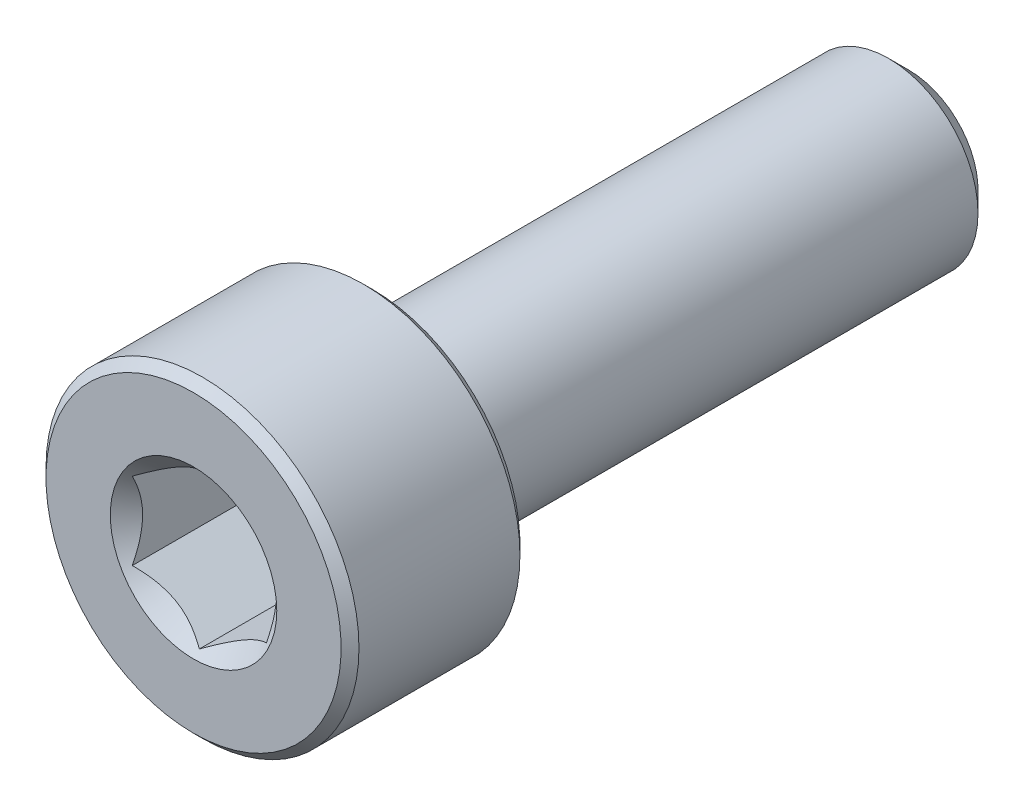
ISO-10303-21;
HEADER;
FILE_DESCRIPTION(('STEP AP214'),'2;1');
FILE_NAME('part.step','',(''),(''),'','','');
FILE_SCHEMA(('AUTOMOTIVE_DESIGN { 1 0 10303 214 1 1 1 1 }'));
ENDSEC;
DATA;
#1=APPLICATION_CONTEXT('core data for automotive mechanical design processes');
#2=APPLICATION_PROTOCOL_DEFINITION('international standard','automotive_design',2000,#1);
#3=PRODUCT_CONTEXT('',#1,'mechanical');
#4=PRODUCT('Part','Part','',(#3));
#5=PRODUCT_RELATED_PRODUCT_CATEGORY('part','',(#4));
#6=PRODUCT_DEFINITION_FORMATION('','',#4);
#7=PRODUCT_DEFINITION_CONTEXT('part definition',#1,'design');
#8=PRODUCT_DEFINITION('design','',#6,#7);
#9=PRODUCT_DEFINITION_SHAPE('','',#8);
#10=(LENGTH_UNIT() NAMED_UNIT(*) SI_UNIT(.MILLI.,.METRE.));
#11=(NAMED_UNIT(*) PLANE_ANGLE_UNIT() SI_UNIT($,.RADIAN.));
#12=(NAMED_UNIT(*) SI_UNIT($,.STERADIAN.) SOLID_ANGLE_UNIT());
#13=UNCERTAINTY_MEASURE_WITH_UNIT(LENGTH_MEASURE(1.E-05),#10,'distance_accuracy_value','');
#14=(GEOMETRIC_REPRESENTATION_CONTEXT(3) GLOBAL_UNCERTAINTY_ASSIGNED_CONTEXT((#13)) GLOBAL_UNIT_ASSIGNED_CONTEXT((#10,
#11,#12)) REPRESENTATION_CONTEXT('',''));
#15=CARTESIAN_POINT('',(0.,0.,0.));
#16=DIRECTION('',(0.,0.,1.));
#17=DIRECTION('',(1.,0.,0.));
#18=AXIS2_PLACEMENT_3D('',#15,#16,#17);
#19=CARTESIAN_POINT('',(0.,1.54533666301317,-8.));
#20=DIRECTION('',(0.,0.,-1.));
#21=DIRECTION('',(0.,1.,0.));
#22=AXIS2_PLACEMENT_3D('',#19,#20,#21);
#23=PLANE('',#22);
#24=CARTESIAN_POINT('',(0.,0.,-8.));
#25=DIRECTION('',(0.,0.,-1.));
#26=DIRECTION('',(0.,1.,0.));
#27=AXIS2_PLACEMENT_3D('',#24,#25,#26);
#28=CIRCLE('',#27,1.54533666301317);
#29=CARTESIAN_POINT('',(0.,1.54533666301317,-8.));
#30=VERTEX_POINT('',#29);
#31=EDGE_CURVE('E57',#30,#30,#28,.T.);
#32=ORIENTED_EDGE('',*,*,#31,.T.);
#33=EDGE_LOOP('',(#32));
#34=FACE_BOUND('',#33,.T.);
#35=ADVANCED_FACE('F43',(#34),#23,.T.);
#36=CARTESIAN_POINT('',(0.,0.,-8.));
#37=DIRECTION('',(0.,0.,1.));
#38=DIRECTION('',(0.,-1.,0.));
#39=AXIS2_PLACEMENT_3D('',#36,#37,#38);
#40=CONICAL_SURFACE('',#39,1.54533666301317,0.785398163397446);
#41=CARTESIAN_POINT('',(0.,0.,-7.54533666301317));
#42=DIRECTION('',(0.,0.,-1.));
#43=DIRECTION('',(0.,1.,0.));
#44=AXIS2_PLACEMENT_3D('',#41,#42,#43);
#45=CIRCLE('',#44,2.);
#46=CARTESIAN_POINT('',(0.,2.,-7.54533666301317));
#47=VERTEX_POINT('',#46);
#48=EDGE_CURVE('E175',#47,#47,#45,.T.);
#49=ORIENTED_EDGE('',*,*,#48,.T.);
#50=EDGE_LOOP('',(#49));
#51=FACE_BOUND('',#50,.T.);
#52=ORIENTED_EDGE('',*,*,#31,.F.);
#53=EDGE_LOOP('',(#52));
#54=FACE_BOUND('',#53,.T.);
#55=ADVANCED_FACE('F183',(#51,#54),#40,.T.);
#56=CARTESIAN_POINT('',(0.,0.,-8.));
#57=DIRECTION('',(0.,0.,-1.));
#58=DIRECTION('',(0.,1.,0.));
#59=AXIS2_PLACEMENT_3D('',#56,#57,#58);
#60=CYLINDRICAL_SURFACE('',#59,2.);
#61=CARTESIAN_POINT('',(0.,0.,3.8));
#62=DIRECTION('',(0.,0.,-1.));
#63=DIRECTION('',(0.,1.,0.));
#64=AXIS2_PLACEMENT_3D('',#61,#62,#63);
#65=CIRCLE('',#64,2.);
#66=CARTESIAN_POINT('',(0.,2.,3.8));
#67=VERTEX_POINT('',#66);
#68=EDGE_CURVE('E171',#67,#67,#65,.T.);
#69=ORIENTED_EDGE('',*,*,#68,.T.);
#70=EDGE_LOOP('',(#69));
#71=FACE_BOUND('',#70,.T.);
#72=ORIENTED_EDGE('',*,*,#48,.F.);
#73=EDGE_LOOP('',(#72));
#74=FACE_BOUND('',#73,.T.);
#75=ADVANCED_FACE('F185',(#71,#74),#60,.T.);
#76=CARTESIAN_POINT('',(0.,0.,3.8));
#77=DIRECTION('',(0.,0.,-1.));
#78=DIRECTION('',(0.,1.,0.));
#79=AXIS2_PLACEMENT_3D('',#76,#77,#78);
#80=TOROIDAL_SURFACE('',#79,2.2,0.200000000000001);
#81=CARTESIAN_POINT('',(0.,0.,4.));
#82=DIRECTION('',(0.,0.,-1.));
#83=DIRECTION('',(0.,1.,0.));
#84=AXIS2_PLACEMENT_3D('',#81,#82,#83);
#85=CIRCLE('',#84,2.2);
#86=CARTESIAN_POINT('',(0.,2.2,4.));
#87=VERTEX_POINT('',#86);
#88=EDGE_CURVE('E167',#87,#87,#85,.T.);
#89=ORIENTED_EDGE('',*,*,#88,.T.);
#90=EDGE_LOOP('',(#89));
#91=FACE_BOUND('',#90,.T.);
#92=ORIENTED_EDGE('',*,*,#68,.F.);
#93=EDGE_LOOP('',(#92));
#94=FACE_BOUND('',#93,.T.);
#95=ADVANCED_FACE('F191',(#91,#94),#80,.F.);
#96=CARTESIAN_POINT('',(0.,3.3,4.));
#97=DIRECTION('',(0.,0.,-1.));
#98=DIRECTION('',(0.,1.,0.));
#99=AXIS2_PLACEMENT_3D('',#96,#97,#98);
#100=PLANE('',#99);
#101=CARTESIAN_POINT('',(0.,0.,4.));
#102=DIRECTION('',(0.,0.,-1.));
#103=DIRECTION('',(0.,1.,0.));
#104=AXIS2_PLACEMENT_3D('',#101,#102,#103);
#105=CIRCLE('',#104,3.3);
#106=CARTESIAN_POINT('',(0.,3.3,4.));
#107=VERTEX_POINT('',#106);
#108=EDGE_CURVE('E163',#107,#107,#105,.T.);
#109=ORIENTED_EDGE('',*,*,#108,.T.);
#110=EDGE_LOOP('',(#109));
#111=FACE_BOUND('',#110,.T.);
#112=ORIENTED_EDGE('',*,*,#88,.F.);
#113=EDGE_LOOP('',(#112));
#114=FACE_BOUND('',#113,.T.);
#115=ADVANCED_FACE('F197',(#111,#114),#100,.T.);
#116=CARTESIAN_POINT('',(0.,0.,4.));
#117=DIRECTION('',(0.,0.,1.));
#118=DIRECTION('',(0.,-1.,0.));
#119=AXIS2_PLACEMENT_3D('',#116,#117,#118);
#120=CONICAL_SURFACE('',#119,3.3,0.785398163397452);
#121=CARTESIAN_POINT('',(0.,0.,4.2));
#122=DIRECTION('',(0.,0.,-1.));
#123=DIRECTION('',(0.,1.,0.));
#124=AXIS2_PLACEMENT_3D('',#121,#122,#123);
#125=CIRCLE('',#124,3.5);
#126=CARTESIAN_POINT('',(0.,3.5,4.2));
#127=VERTEX_POINT('',#126);
#128=EDGE_CURVE('E159',#127,#127,#125,.T.);
#129=ORIENTED_EDGE('',*,*,#128,.T.);
#130=EDGE_LOOP('',(#129));
#131=FACE_BOUND('',#130,.T.);
#132=ORIENTED_EDGE('',*,*,#108,.F.);
#133=EDGE_LOOP('',(#132));
#134=FACE_BOUND('',#133,.T.);
#135=ADVANCED_FACE('F201',(#131,#134),#120,.T.);
#136=CARTESIAN_POINT('',(0.,0.,-8.));
#137=DIRECTION('',(0.,0.,-1.));
#138=DIRECTION('',(0.,1.,0.));
#139=AXIS2_PLACEMENT_3D('',#136,#137,#138);
#140=CYLINDRICAL_SURFACE('',#139,3.5);
#141=CARTESIAN_POINT('',(0.,0.,7.8));
#142=DIRECTION('',(0.,0.,-1.));
#143=DIRECTION('',(0.,1.,0.));
#144=AXIS2_PLACEMENT_3D('',#141,#142,#143);
#145=CIRCLE('',#144,3.5);
#146=CARTESIAN_POINT('',(0.,3.5,7.8));
#147=VERTEX_POINT('',#146);
#148=EDGE_CURVE('E155',#147,#147,#145,.T.);
#149=ORIENTED_EDGE('',*,*,#148,.T.);
#150=EDGE_LOOP('',(#149));
#151=FACE_BOUND('',#150,.T.);
#152=ORIENTED_EDGE('',*,*,#128,.F.);
#153=EDGE_LOOP('',(#152));
#154=FACE_BOUND('',#153,.T.);
#155=ADVANCED_FACE('F205',(#151,#154),#140,.T.);
#156=CARTESIAN_POINT('',(0.,0.,7.8));
#157=DIRECTION('',(0.,0.,-1.));
#158=DIRECTION('',(0.,1.,0.));
#159=AXIS2_PLACEMENT_3D('',#156,#157,#158);
#160=CONICAL_SURFACE('',#159,3.5,0.785398163397452);
#161=CARTESIAN_POINT('',(0.,0.,8.));
#162=DIRECTION('',(0.,0.,-1.));
#163=DIRECTION('',(0.,1.,0.));
#164=AXIS2_PLACEMENT_3D('',#161,#162,#163);
#165=CIRCLE('',#164,3.3);
#166=CARTESIAN_POINT('',(0.,3.3,8.));
#167=VERTEX_POINT('',#166);
#168=EDGE_CURVE('E151',#167,#167,#165,.T.);
#169=ORIENTED_EDGE('',*,*,#168,.T.);
#170=EDGE_LOOP('',(#169));
#171=FACE_BOUND('',#170,.T.);
#172=ORIENTED_EDGE('',*,*,#148,.F.);
#173=EDGE_LOOP('',(#172));
#174=FACE_BOUND('',#173,.T.);
#175=ADVANCED_FACE('F209',(#171,#174),#160,.T.);
#176=CARTESIAN_POINT('',(0.,0.,8.));
#177=DIRECTION('',(0.,0.,1.));
#178=DIRECTION('',(0.,-1.,0.));
#179=AXIS2_PLACEMENT_3D('',#176,#177,#178);
#180=PLANE('',#179);
#181=CARTESIAN_POINT('',(0.,0.,8.));
#182=DIRECTION('',(0.,0.,1.));
#183=DIRECTION('',(1.,0.,0.));
#184=AXIS2_PLACEMENT_3D('',#181,#182,#183);
#185=CIRCLE('',#184,1.86195461813654);
#186=CARTESIAN_POINT('',(1.86195461813654,0.,8.));
#187=VERTEX_POINT('',#186);
#188=EDGE_CURVE('E117',#187,#187,#185,.T.);
#189=ORIENTED_EDGE('',*,*,#188,.F.);
#190=EDGE_LOOP('',(#189));
#191=FACE_BOUND('',#190,.T.);
#192=ORIENTED_EDGE('',*,*,#168,.F.);
#193=EDGE_LOOP('',(#192));
#194=FACE_BOUND('',#193,.T.);
#195=ADVANCED_FACE('F213',(#191,#194),#180,.T.);
#196=CARTESIAN_POINT('',(0.,0.,8.));
#197=DIRECTION('',(0.,0.,1.));
#198=DIRECTION('',(1.,0.,0.));
#199=AXIS2_PLACEMENT_3D('',#196,#197,#198);
#200=CONICAL_SURFACE('',#199,1.86195461813654,0.78539816339745);
#201=ORIENTED_EDGE('',*,*,#188,.T.);
#202=EDGE_LOOP('',(#201));
#203=FACE_BOUND('',#202,.T.);
#204=CARTESIAN_POINT('',(-0.000199999999999267,-1.73216627762272,7.87021167103241));
#205=CARTESIAN_POINT('',(0.0513677907370764,-1.70239359975915,7.84046166549966));
#206=CARTESIAN_POINT('',(0.103797917665202,-1.67212305186355,7.81245867334265));
#207=CARTESIAN_POINT('',(0.210709034055597,-1.61039789003619,7.76118541987248));
#208=CARTESIAN_POINT('',(0.265200195814662,-1.57893740312614,7.73794369447671));
#209=CARTESIAN_POINT('',(0.375079081357249,-1.51549879897987,7.69812991842456));
#210=CARTESIAN_POINT('',(0.4304388090952,-1.4835368452681,7.68145777510323));
#211=CARTESIAN_POINT('',(0.542377257477151,-1.41890915196211,7.65577064625044));
#212=CARTESIAN_POINT('',(0.598952556553009,-1.38624538781118,7.6467364799112));
#213=CARTESIAN_POINT('',(0.696455389516441,-1.32995210095299,7.63858527065919));
#214=CARTESIAN_POINT('',(0.737256908280467,-1.30639533311124,7.63737844242155));
#215=CARTESIAN_POINT('',(0.818787969615859,-1.25932335290193,7.6394102465946));
#216=CARTESIAN_POINT('',(0.859517494314631,-1.23580815085313,7.64264986018064));
#217=CARTESIAN_POINT('',(0.940584402163417,-1.18900414978427,7.6533881754143));
#218=CARTESIAN_POINT('',(0.980921384598289,-1.16571558211719,7.66089084245107));
#219=CARTESIAN_POINT('',(1.06091833691403,-1.11952932016335,7.67974780136063));
#220=CARTESIAN_POINT('',(1.10057800851621,-1.09663179808786,7.69110374645092));
#221=CARTESIAN_POINT('',(1.20216313477449,-1.03798159809698,7.72481783702501));
#222=CARTESIAN_POINT('',(1.26345855370969,-1.00259267147465,7.7497180385257));
#223=CARTESIAN_POINT('',(1.35358562846331,-0.950557780604374,7.79175284270391));
#224=CARTESIAN_POINT('',(1.38328513990772,-0.933410759677148,7.80652134299143));
#225=CARTESIAN_POINT('',(1.44213790138375,-0.899432101996407,7.8374067553725));
#226=CARTESIAN_POINT('',(1.47129140422064,-0.88260031928571,7.85352302355405));
#227=CARTESIAN_POINT('',(1.5002,-0.865909933730601,7.87021167103241));
#228=B_SPLINE_CURVE_WITH_KNOTS('',3,(#204,#205,#206,#207,#208,#209,#210,#211,#212,#213,#214,
#215,#216,#217,#218,#219,#220,#221,#222,#223,#224,#225,#226,#227),.UNSPECIFIED.,.F.,.F.,(4,2,2,
2,2,2,2,2,2,2,2,4),(0.,0.199829143693305,0.400822987382389,0.598623720538181,0.795926240188889,
0.937113067959881,1.07833105577193,1.21968061668222,1.36109089931054,1.58570969637565,
1.69770705470963,1.80965120737194),.UNSPECIFIED.);
#229=CARTESIAN_POINT('',(0.,-1.73205080756888,7.87009618943234));
#230=VERTEX_POINT('',#229);
#231=CARTESIAN_POINT('',(1.5,-0.866025403784439,7.87009618943233));
#232=VERTEX_POINT('',#231);
#233=EDGE_CURVE('E12',#230,#232,#228,.T.);
#234=ORIENTED_EDGE('',*,*,#233,.F.);
#235=CARTESIAN_POINT('',(-1.5002,-0.865909933730601,7.87021167103241));
#236=CARTESIAN_POINT('',(-1.44863220926292,-0.895682611594166,7.84046166549966));
#237=CARTESIAN_POINT('',(-1.3962020823348,-0.925953159489765,7.81245867334265));
#238=CARTESIAN_POINT('',(-1.2892909659444,-0.987678321317124,7.76118541987248));
#239=CARTESIAN_POINT('',(-1.23479980418534,-1.01913880822718,7.73794369447671));
#240=CARTESIAN_POINT('',(-1.12492091864275,-1.08257741237344,7.69812991842456));
#241=CARTESIAN_POINT('',(-1.0695611909048,-1.11453936608521,7.68145777510323));
#242=CARTESIAN_POINT('',(-0.957622742522849,-1.1791670593912,7.65577064625044));
#243=CARTESIAN_POINT('',(-0.901047443446991,-1.21183082354213,7.6467364799112));
#244=CARTESIAN_POINT('',(-0.803544610483559,-1.26812411040032,7.63858527065919));
#245=CARTESIAN_POINT('',(-0.762743091719534,-1.29168087824208,7.63737844242155));
#246=CARTESIAN_POINT('',(-0.681212030384142,-1.33875285845138,7.6394102465946));
#247=CARTESIAN_POINT('',(-0.64048250568537,-1.36226806050018,7.64264986018064));
#248=CARTESIAN_POINT('',(-0.559415597836584,-1.40907206156905,7.6533881754143));
#249=CARTESIAN_POINT('',(-0.519078615401712,-1.43236062923612,7.66089084245107));
#250=CARTESIAN_POINT('',(-0.439081663085969,-1.47854689118996,7.67974780136063));
#251=CARTESIAN_POINT('',(-0.399421991483792,-1.50144441326545,7.69110374645092));
#252=CARTESIAN_POINT('',(-0.297836865225515,-1.56009461325633,7.72481783702501));
#253=CARTESIAN_POINT('',(-0.236541446290311,-1.59548353987866,7.7497180385257));
#254=CARTESIAN_POINT('',(-0.146414371536687,-1.64751843074894,7.79175284270391));
#255=CARTESIAN_POINT('',(-0.116714860092283,-1.66466545167617,7.80652134299143));
#256=CARTESIAN_POINT('',(-0.0578620986162491,-1.69864410935691,7.8374067553725));
#257=CARTESIAN_POINT('',(-0.0287085957793627,-1.71547589206761,7.85352302355404));
#258=CARTESIAN_POINT('',(0.000200000000000315,-1.73216627762272,7.87021167103241));
#259=B_SPLINE_CURVE_WITH_KNOTS('',3,(#235,#236,#237,#238,#239,#240,#241,#242,#243,#244,#245,
#246,#247,#248,#249,#250,#251,#252,#253,#254,#255,#256,#257,#258),.UNSPECIFIED.,.F.,.F.,(4,2,2,
2,2,2,2,2,2,2,2,4),(0.,0.199829143693304,0.400822987382388,0.598623720538181,0.795926240188889,
0.937113067959881,1.07833105577193,1.21968061668222,1.36109089931054,1.58570969637565,
1.69770705470964,1.80965120737194),.UNSPECIFIED.);
#260=CARTESIAN_POINT('',(-1.5,-0.866025403784439,7.87009618943234));
#261=VERTEX_POINT('',#260);
#262=EDGE_CURVE('E102',#261,#230,#259,.T.);
#263=ORIENTED_EDGE('',*,*,#262,.F.);
#264=CARTESIAN_POINT('',(-1.5,-1.81798631684901,8.49496588290931));
#265=CARTESIAN_POINT('',(-1.5,-1.77410479833239,8.46112335419702));
#266=CARTESIAN_POINT('',(-1.5,-1.72998897047494,8.42758561768896));
#267=CARTESIAN_POINT('',(-1.5,-1.64119029432319,8.36124817349268));
#268=CARTESIAN_POINT('',(-1.5,-1.59650731534755,8.328448640911));
#269=CARTESIAN_POINT('',(-1.5,-1.460806940489,8.23088193148043));
#270=CARTESIAN_POINT('',(-1.5,-1.36880251235632,8.1674654206559));
#271=CARTESIAN_POINT('',(-1.5,-1.17526237686872,8.04210237172158));
#272=CARTESIAN_POINT('',(-1.5,-1.07349393006072,7.98051141536721));
#273=CARTESIAN_POINT('',(-1.5,-0.864764842560628,7.86725220599653));
#274=CARTESIAN_POINT('',(-1.5,-0.75782333444995,7.81555043950584));
#275=CARTESIAN_POINT('',(-1.5,-0.598146069886858,7.75227317361643));
#276=CARTESIAN_POINT('',(-1.5,-0.547969945491557,7.73427408399124));
#277=CARTESIAN_POINT('',(-1.5,-0.446326869364775,7.70229546522083));
#278=CARTESIAN_POINT('',(-1.5,-0.394859836419925,7.68831618966241));
#279=CARTESIAN_POINT('',(-1.5,-0.291848397493325,7.66536569037263));
#280=CARTESIAN_POINT('',(-1.5,-0.240324749628771,7.65630281543282));
#281=CARTESIAN_POINT('',(-1.5,-0.13662544851591,7.64337711521516));
#282=CARTESIAN_POINT('',(-1.5,-0.0844499362377799,7.6395131846234));
#283=CARTESIAN_POINT('',(-1.5,0.0176806967011133,7.63731961256892));
#284=CARTESIAN_POINT('',(-1.5,0.067630704511662,7.63875006923659));
#285=CARTESIAN_POINT('',(-1.5,0.167145477637761,7.64651331423855));
#286=CARTESIAN_POINT('',(-1.5,0.216710207908514,7.6528465433779));
#287=CARTESIAN_POINT('',(-1.5,0.315937150651983,7.67016271707146));
#288=CARTESIAN_POINT('',(-1.5,0.365584733694539,7.68122815181031));
#289=CARTESIAN_POINT('',(-1.5,0.46378160619877,7.70739349919908));
#290=CARTESIAN_POINT('',(-1.5,0.512330953840259,7.72249319758548));
#291=CARTESIAN_POINT('',(-1.5,0.661313023287691,7.77461385569168));
#292=CARTESIAN_POINT('',(-1.5,0.759720789706278,7.81740496304236));
#293=CARTESIAN_POINT('',(-1.5,0.951942669022771,7.91263883721007));
#294=CARTESIAN_POINT('',(-1.5,1.04573912191844,7.96511552648595));
#295=CARTESIAN_POINT('',(-1.5,1.22504153577549,8.0734783373155));
#296=CARTESIAN_POINT('',(-1.5,1.3107282773288,8.12906910554414));
#297=CARTESIAN_POINT('',(-1.5,1.43696960041027,8.21505045621636));
#298=CARTESIAN_POINT('',(-1.5,1.47850725450332,8.24402268297088));
#299=CARTESIAN_POINT('',(-1.5,1.56101250374723,8.30274488393776));
#300=CARTESIAN_POINT('',(-1.5,1.60198025290925,8.33249464151831));
#301=CARTESIAN_POINT('',(-1.5,1.64271029717086,8.36256715528604));
#302=B_SPLINE_CURVE_WITH_KNOTS('',3,(#264,#265,#266,#267,#268,#269,#270,#271,#272,#273,#274,
#275,#276,#277,#278,#279,#280,#281,#282,#283,#284,#285,#286,#287,#288,#289,#290,#291,#292,#293,
#294,#295,#296,#297,#298,#299,#300,#301),.UNSPECIFIED.,.F.,.F.,(4,2,2,2,2,2,2,2,2,2,2,2,2,2,2,2,
2,2,4),(0.,0.166243250325255,0.332525527595493,0.667617582874062,1.02421660314856,
1.37958485991001,1.53937185590113,1.69916892971772,1.85587466130012,2.01254707142443,
2.16220898927398,2.31188436469119,2.46428258498153,2.61667271286895,2.93766301623296,
3.25979964661299,3.56606529199603,3.71798989158865,3.86987260467919),.UNSPECIFIED.);
#303=CARTESIAN_POINT('',(-1.5,0.866025403784438,7.87009618943233));
#304=VERTEX_POINT('',#303);
#305=EDGE_CURVE('E116',#304,#261,#302,.F.);
#306=ORIENTED_EDGE('',*,*,#305,.F.);
#307=CARTESIAN_POINT('',(0.000199999999999471,1.73216627762272,7.87021167103241));
#308=CARTESIAN_POINT('',(-0.0513677907370761,1.70239359975915,7.84046166549966));
#309=CARTESIAN_POINT('',(-0.103797917665201,1.67212305186355,7.81245867334265));
#310=CARTESIAN_POINT('',(-0.210709034055597,1.61039789003619,7.76118541987248));
#311=CARTESIAN_POINT('',(-0.265200195814661,1.57893740312614,7.73794369447671));
#312=CARTESIAN_POINT('',(-0.375079081357249,1.51549879897987,7.69812991842456));
#313=CARTESIAN_POINT('',(-0.4304388090952,1.4835368452681,7.68145777510323));
#314=CARTESIAN_POINT('',(-0.542377257477151,1.41890915196211,7.65577064625044));
#315=CARTESIAN_POINT('',(-0.598952556553009,1.38624538781118,7.6467364799112));
#316=CARTESIAN_POINT('',(-0.696455389516441,1.32995210095299,7.63858527065919));
#317=CARTESIAN_POINT('',(-0.737256908280467,1.30639533311124,7.63737844242155));
#318=CARTESIAN_POINT('',(-0.818787969615859,1.25932335290193,7.6394102465946));
#319=CARTESIAN_POINT('',(-0.85951749431463,1.23580815085313,7.64264986018064));
#320=CARTESIAN_POINT('',(-0.940584402163416,1.18900414978427,7.6533881754143));
#321=CARTESIAN_POINT('',(-0.980921384598288,1.1657155821172,7.66089084245107));
#322=CARTESIAN_POINT('',(-1.06091833691403,1.11952932016335,7.67974780136063));
#323=CARTESIAN_POINT('',(-1.10057800851621,1.09663179808786,7.69110374645092));
#324=CARTESIAN_POINT('',(-1.20216313477449,1.03798159809698,7.72481783702501));
#325=CARTESIAN_POINT('',(-1.26345855370969,1.00259267147465,7.7497180385257));
#326=CARTESIAN_POINT('',(-1.35358562846331,0.950557780604375,7.79175284270391));
#327=CARTESIAN_POINT('',(-1.38328513990772,0.933410759677147,7.80652134299143));
#328=CARTESIAN_POINT('',(-1.44213790138375,0.899432101996407,7.8374067553725));
#329=CARTESIAN_POINT('',(-1.47129140422064,0.88260031928571,7.85352302355404));
#330=CARTESIAN_POINT('',(-1.5002,0.865909933730601,7.87021167103241));
#331=B_SPLINE_CURVE_WITH_KNOTS('',3,(#307,#308,#309,#310,#311,#312,#313,#314,#315,#316,#317,
#318,#319,#320,#321,#322,#323,#324,#325,#326,#327,#328,#329,#330),.UNSPECIFIED.,.F.,.F.,(4,2,2,
2,2,2,2,2,2,2,2,4),(0.,0.199829143693305,0.400822987382389,0.598623720538181,0.795926240188889,
0.937113067959881,1.07833105577193,1.21968061668222,1.36109089931054,1.58570969637565,
1.69770705470963,1.80965120737194),.UNSPECIFIED.);
#332=CARTESIAN_POINT('',(0.,1.73205080756888,7.87009618943234));
#333=VERTEX_POINT('',#332);
#334=EDGE_CURVE('E264',#333,#304,#331,.T.);
#335=ORIENTED_EDGE('',*,*,#334,.F.);
#336=CARTESIAN_POINT('',(1.5002,0.865909933730601,7.87021167103241));
#337=CARTESIAN_POINT('',(1.44863220926292,0.895682611594166,7.84046166549966));
#338=CARTESIAN_POINT('',(1.3962020823348,0.925953159489765,7.81245867334265));
#339=CARTESIAN_POINT('',(1.2892909659444,0.987678321317124,7.76118541987248));
#340=CARTESIAN_POINT('',(1.23479980418534,1.01913880822718,7.73794369447671));
#341=CARTESIAN_POINT('',(1.12492091864275,1.08257741237344,7.69812991842456));
#342=CARTESIAN_POINT('',(1.0695611909048,1.11453936608521,7.68145777510323));
#343=CARTESIAN_POINT('',(0.957622742522849,1.1791670593912,7.65577064625044));
#344=CARTESIAN_POINT('',(0.901047443446991,1.21183082354213,7.6467364799112));
#345=CARTESIAN_POINT('',(0.803544610483559,1.26812411040032,7.63858527065919));
#346=CARTESIAN_POINT('',(0.762743091719534,1.29168087824208,7.63737844242155));
#347=CARTESIAN_POINT('',(0.681212030384142,1.33875285845138,7.6394102465946));
#348=CARTESIAN_POINT('',(0.64048250568537,1.36226806050018,7.64264986018064));
#349=CARTESIAN_POINT('',(0.559415597836584,1.40907206156905,7.6533881754143));
#350=CARTESIAN_POINT('',(0.519078615401712,1.43236062923612,7.66089084245107));
#351=CARTESIAN_POINT('',(0.439081663085969,1.47854689118996,7.67974780136062));
#352=CARTESIAN_POINT('',(0.399421991483792,1.50144441326545,7.69110374645092));
#353=CARTESIAN_POINT('',(0.297836865225515,1.56009461325633,7.72481783702501));
#354=CARTESIAN_POINT('',(0.236541446290311,1.59548353987866,7.7497180385257));
#355=CARTESIAN_POINT('',(0.146414371536687,1.64751843074894,7.79175284270391));
#356=CARTESIAN_POINT('',(0.116714860092283,1.66466545167617,7.80652134299143));
#357=CARTESIAN_POINT('',(0.0578620986162498,1.69864410935691,7.8374067553725));
#358=CARTESIAN_POINT('',(0.0287085957793633,1.71547589206761,7.85352302355404));
#359=CARTESIAN_POINT('',(-0.000200000000000031,1.73216627762272,7.87021167103241));
#360=B_SPLINE_CURVE_WITH_KNOTS('',3,(#336,#337,#338,#339,#340,#341,#342,#343,#344,#345,#346,
#347,#348,#349,#350,#351,#352,#353,#354,#355,#356,#357,#358,#359),.UNSPECIFIED.,.F.,.F.,(4,2,2,
2,2,2,2,2,2,2,2,4),(0.,0.199829143693305,0.400822987382388,0.598623720538181,0.795926240188889,
0.937113067959881,1.07833105577193,1.21968061668222,1.36109089931054,1.58570969637565,
1.69770705470964,1.80965120737194),.UNSPECIFIED.);
#361=CARTESIAN_POINT('',(1.5,0.866025403784439,7.87009618943234));
#362=VERTEX_POINT('',#361);
#363=EDGE_CURVE('E237',#362,#333,#360,.T.);
#364=ORIENTED_EDGE('',*,*,#363,.F.);
#365=CARTESIAN_POINT('',(1.5,-1.81798631684901,8.49496588290931));
#366=CARTESIAN_POINT('',(1.5,-1.77410479833239,8.46112335419702));
#367=CARTESIAN_POINT('',(1.5,-1.72998897047494,8.42758561768896));
#368=CARTESIAN_POINT('',(1.5,-1.64119029432319,8.36124817349268));
#369=CARTESIAN_POINT('',(1.5,-1.59650731534755,8.328448640911));
#370=CARTESIAN_POINT('',(1.5,-1.460806940489,8.23088193148043));
#371=CARTESIAN_POINT('',(1.5,-1.36880251235632,8.1674654206559));
#372=CARTESIAN_POINT('',(1.5,-1.17526237686872,8.04210237172158));
#373=CARTESIAN_POINT('',(1.5,-1.07349393006072,7.98051141536721));
#374=CARTESIAN_POINT('',(1.5,-0.864764842560627,7.86725220599653));
#375=CARTESIAN_POINT('',(1.5,-0.757823334449949,7.81555043950584));
#376=CARTESIAN_POINT('',(1.5,-0.598146069886858,7.75227317361643));
#377=CARTESIAN_POINT('',(1.5,-0.547969945491557,7.73427408399124));
#378=CARTESIAN_POINT('',(1.5,-0.446326869364774,7.70229546522083));
#379=CARTESIAN_POINT('',(1.5,-0.394859836419925,7.68831618966241));
#380=CARTESIAN_POINT('',(1.5,-0.291848397493325,7.66536569037263));
#381=CARTESIAN_POINT('',(1.5,-0.240324749628771,7.65630281543282));
#382=CARTESIAN_POINT('',(1.5,-0.13662544851591,7.64337711521516));
#383=CARTESIAN_POINT('',(1.5,-0.08444993623778,7.6395131846234));
#384=CARTESIAN_POINT('',(1.5,0.0176806967011131,7.63731961256892));
#385=CARTESIAN_POINT('',(1.5,0.0676307045116619,7.63875006923659));
#386=CARTESIAN_POINT('',(1.5,0.16714547763776,7.64651331423855));
#387=CARTESIAN_POINT('',(1.5,0.216710207908513,7.6528465433779));
#388=CARTESIAN_POINT('',(1.5,0.315937150651982,7.67016271707146));
#389=CARTESIAN_POINT('',(1.5,0.365584733694538,7.68122815181031));
#390=CARTESIAN_POINT('',(1.5,0.463781606198769,7.70739349919908));
#391=CARTESIAN_POINT('',(1.5,0.512330953840259,7.72249319758548));
#392=CARTESIAN_POINT('',(1.5,0.66131302328769,7.77461385569168));
#393=CARTESIAN_POINT('',(1.5,0.759720789706277,7.81740496304236));
#394=CARTESIAN_POINT('',(1.5,0.95194266902277,7.91263883721007));
#395=CARTESIAN_POINT('',(1.5,1.04573912191844,7.96511552648595));
#396=CARTESIAN_POINT('',(1.5,1.22504153577549,8.0734783373155));
#397=CARTESIAN_POINT('',(1.5,1.3107282773288,8.12906910554414));
#398=CARTESIAN_POINT('',(1.5,1.43696960041027,8.21505045621636));
#399=CARTESIAN_POINT('',(1.5,1.47850725450332,8.24402268297088));
#400=CARTESIAN_POINT('',(1.5,1.56101250374723,8.30274488393776));
#401=CARTESIAN_POINT('',(1.5,1.60198025290925,8.33249464151831));
#402=CARTESIAN_POINT('',(1.5,1.64271029717086,8.36256715528604));
#403=B_SPLINE_CURVE_WITH_KNOTS('',3,(#365,#366,#367,#368,#369,#370,#371,#372,#373,#374,#375,
#376,#377,#378,#379,#380,#381,#382,#383,#384,#385,#386,#387,#388,#389,#390,#391,#392,#393,#394,
#395,#396,#397,#398,#399,#400,#401,#402),.UNSPECIFIED.,.F.,.F.,(4,2,2,2,2,2,2,2,2,2,2,2,2,2,2,2,
2,2,4),(0.,0.166243250325255,0.332525527595493,0.667617582874063,1.02421660314856,
1.37958485991002,1.53937185590113,1.69916892971772,1.85587466130012,2.01254707142443,
2.16220898927398,2.31188436469119,2.46428258498153,2.61667271286895,2.93766301623296,
3.25979964661299,3.56606529199602,3.71798989158865,3.86987260467919),.UNSPECIFIED.);
#404=EDGE_CURVE('E64',#232,#362,#403,.T.);
#405=ORIENTED_EDGE('',*,*,#404,.F.);
#406=EDGE_LOOP('',(#234,#263,#306,#335,#364,#405));
#407=FACE_BOUND('',#406,.T.);
#408=ADVANCED_FACE('F101',(#203,#407),#200,.F.);
#409=CARTESIAN_POINT('',(0.,3.3,5.));
#410=DIRECTION('',(0.,0.,-1.));
#411=DIRECTION('',(0.,1.,0.));
#412=AXIS2_PLACEMENT_3D('',#409,#410,#411);
#413=PLANE('',#412);
#414=DIRECTION('',(0.866025403784438,0.5,0.));
#415=VECTOR('',#414,1.);
#416=CARTESIAN_POINT('',(0.,-1.73205080756888,5.));
#417=LINE('',#416,#415);
#418=CARTESIAN_POINT('',(0.,-1.73205080756888,5.));
#419=VERTEX_POINT('',#418);
#420=CARTESIAN_POINT('',(1.5,-0.866025403784439,5.));
#421=VERTEX_POINT('',#420);
#422=EDGE_CURVE('E120',#419,#421,#417,.T.);
#423=ORIENTED_EDGE('',*,*,#422,.T.);
#424=DIRECTION('',(0.,1.,0.));
#425=VECTOR('',#424,1.);
#426=CARTESIAN_POINT('',(1.5,-0.866025403784439,5.));
#427=LINE('',#426,#425);
#428=CARTESIAN_POINT('',(1.5,0.866025403784439,5.));
#429=VERTEX_POINT('',#428);
#430=EDGE_CURVE('E71',#421,#429,#427,.T.);
#431=ORIENTED_EDGE('',*,*,#430,.T.);
#432=DIRECTION('',(-0.866025403784439,0.5,0.));
#433=VECTOR('',#432,1.);
#434=CARTESIAN_POINT('',(1.5,0.866025403784439,5.));
#435=LINE('',#434,#433);
#436=CARTESIAN_POINT('',(0.,1.73205080756888,5.));
#437=VERTEX_POINT('',#436);
#438=EDGE_CURVE('E131',#429,#437,#435,.T.);
#439=ORIENTED_EDGE('',*,*,#438,.T.);
#440=DIRECTION('',(-0.866025403784439,-0.5,0.));
#441=VECTOR('',#440,1.);
#442=CARTESIAN_POINT('',(0.,1.73205080756888,5.));
#443=LINE('',#442,#441);
#444=CARTESIAN_POINT('',(-1.5,0.866025403784439,5.));
#445=VERTEX_POINT('',#444);
#446=EDGE_CURVE('E140',#437,#445,#443,.T.);
#447=ORIENTED_EDGE('',*,*,#446,.T.);
#448=DIRECTION('',(0.,-1.,0.));
#449=VECTOR('',#448,1.);
#450=CARTESIAN_POINT('',(-1.5,0.866025403784438,5.));
#451=LINE('',#450,#449);
#452=CARTESIAN_POINT('',(-1.5,-0.866025403784439,5.));
#453=VERTEX_POINT('',#452);
#454=EDGE_CURVE('E135',#445,#453,#451,.T.);
#455=ORIENTED_EDGE('',*,*,#454,.T.);
#456=DIRECTION('',(0.866025403784439,-0.5,0.));
#457=VECTOR('',#456,1.);
#458=CARTESIAN_POINT('',(-1.5,-0.866025403784439,5.));
#459=LINE('',#458,#457);
#460=EDGE_CURVE('E122',#453,#419,#459,.T.);
#461=ORIENTED_EDGE('',*,*,#460,.T.);
#462=EDGE_LOOP('',(#423,#431,#439,#447,#455,#461));
#463=FACE_BOUND('',#462,.T.);
#464=ADVANCED_FACE('F218',(#463),#413,.F.);
#465=CARTESIAN_POINT('',(0.,-1.73205080756888,-0.582575694955841));
#466=DIRECTION('',(0.5,-0.866025403784438,0.));
#467=DIRECTION('',(0.866025403784438,0.5,0.));
#468=AXIS2_PLACEMENT_3D('',#465,#466,#467);
#469=PLANE('',#468);
#470=DIRECTION('',(0.,0.,1.));
#471=VECTOR('',#470,1.);
#472=CARTESIAN_POINT('',(0.,-1.73205080756888,-0.582575694955841));
#473=LINE('',#472,#471);
#474=EDGE_CURVE('E111',#419,#230,#473,.T.);
#475=ORIENTED_EDGE('',*,*,#474,.T.);
#476=ORIENTED_EDGE('',*,*,#233,.T.);
#477=DIRECTION('',(0.,0.,1.));
#478=VECTOR('',#477,1.);
#479=CARTESIAN_POINT('',(1.5,-0.866025403784439,-0.582575694955841));
#480=LINE('',#479,#478);
#481=EDGE_CURVE('E126',#421,#232,#480,.T.);
#482=ORIENTED_EDGE('',*,*,#481,.F.);
#483=ORIENTED_EDGE('',*,*,#422,.F.);
#484=EDGE_LOOP('',(#475,#476,#482,#483));
#485=FACE_BOUND('',#484,.T.);
#486=ADVANCED_FACE('F119',(#485),#469,.F.);
#487=CARTESIAN_POINT('',(-1.5,-0.866025403784439,-0.582575694955841));
#488=DIRECTION('',(-0.5,-0.866025403784439,0.));
#489=DIRECTION('',(0.866025403784439,-0.5,0.));
#490=AXIS2_PLACEMENT_3D('',#487,#488,#489);
#491=PLANE('',#490);
#492=DIRECTION('',(0.,0.,1.));
#493=VECTOR('',#492,1.);
#494=CARTESIAN_POINT('',(-1.5,-0.866025403784439,-0.582575694955841));
#495=LINE('',#494,#493);
#496=EDGE_CURVE('E114',#453,#261,#495,.T.);
#497=ORIENTED_EDGE('',*,*,#496,.T.);
#498=ORIENTED_EDGE('',*,*,#262,.T.);
#499=ORIENTED_EDGE('',*,*,#474,.F.);
#500=ORIENTED_EDGE('',*,*,#460,.F.);
#501=EDGE_LOOP('',(#497,#498,#499,#500));
#502=FACE_BOUND('',#501,.T.);
#503=ADVANCED_FACE('F110',(#502),#491,.F.);
#504=CARTESIAN_POINT('',(-1.5,0.866025403784438,-0.582575694955841));
#505=DIRECTION('',(-1.,0.,0.));
#506=DIRECTION('',(0.,0.,1.));
#507=AXIS2_PLACEMENT_3D('',#504,#505,#506);
#508=PLANE('',#507);
#509=DIRECTION('',(0.,0.,1.));
#510=VECTOR('',#509,1.);
#511=CARTESIAN_POINT('',(-1.5,0.866025403784438,-0.582575694955841));
#512=LINE('',#511,#510);
#513=EDGE_CURVE('E136',#445,#304,#512,.T.);
#514=ORIENTED_EDGE('',*,*,#513,.T.);
#515=ORIENTED_EDGE('',*,*,#305,.T.);
#516=ORIENTED_EDGE('',*,*,#496,.F.);
#517=ORIENTED_EDGE('',*,*,#454,.F.);
#518=EDGE_LOOP('',(#514,#515,#516,#517));
#519=FACE_BOUND('',#518,.T.);
#520=ADVANCED_FACE('F274',(#519),#508,.F.);
#521=CARTESIAN_POINT('',(0.,1.73205080756888,-0.582575694955841));
#522=DIRECTION('',(-0.5,0.866025403784438,0.));
#523=DIRECTION('',(-0.866025403784439,-0.5,0.));
#524=AXIS2_PLACEMENT_3D('',#521,#522,#523);
#525=PLANE('',#524);
#526=DIRECTION('',(0.,0.,1.));
#527=VECTOR('',#526,1.);
#528=CARTESIAN_POINT('',(0.,1.73205080756888,-0.582575694955841));
#529=LINE('',#528,#527);
#530=EDGE_CURVE('E141',#437,#333,#529,.T.);
#531=ORIENTED_EDGE('',*,*,#530,.T.);
#532=ORIENTED_EDGE('',*,*,#334,.T.);
#533=ORIENTED_EDGE('',*,*,#513,.F.);
#534=ORIENTED_EDGE('',*,*,#446,.F.);
#535=EDGE_LOOP('',(#531,#532,#533,#534));
#536=FACE_BOUND('',#535,.T.);
#537=ADVANCED_FACE('F271',(#536),#525,.F.);
#538=CARTESIAN_POINT('',(1.5,0.866025403784439,-0.582575694955841));
#539=DIRECTION('',(0.5,0.866025403784439,0.));
#540=DIRECTION('',(-0.866025403784439,0.5,0.));
#541=AXIS2_PLACEMENT_3D('',#538,#539,#540);
#542=PLANE('',#541);
#543=DIRECTION('',(0.,0.,1.));
#544=VECTOR('',#543,1.);
#545=CARTESIAN_POINT('',(1.5,0.866025403784439,-0.582575694955841));
#546=LINE('',#545,#544);
#547=EDGE_CURVE('E145',#429,#362,#546,.T.);
#548=ORIENTED_EDGE('',*,*,#547,.T.);
#549=ORIENTED_EDGE('',*,*,#363,.T.);
#550=ORIENTED_EDGE('',*,*,#530,.F.);
#551=ORIENTED_EDGE('',*,*,#438,.F.);
#552=EDGE_LOOP('',(#548,#549,#550,#551));
#553=FACE_BOUND('',#552,.T.);
#554=ADVANCED_FACE('F226',(#553),#542,.F.);
#555=CARTESIAN_POINT('',(1.5,-0.866025403784439,-0.582575694955841));
#556=DIRECTION('',(1.,0.,0.));
#557=DIRECTION('',(0.,0.,-1.));
#558=AXIS2_PLACEMENT_3D('',#555,#556,#557);
#559=PLANE('',#558);
#560=ORIENTED_EDGE('',*,*,#481,.T.);
#561=ORIENTED_EDGE('',*,*,#404,.T.);
#562=ORIENTED_EDGE('',*,*,#547,.F.);
#563=ORIENTED_EDGE('',*,*,#430,.F.);
#564=EDGE_LOOP('',(#560,#561,#562,#563));
#565=FACE_BOUND('',#564,.T.);
#566=ADVANCED_FACE('F222',(#565),#559,.F.);
#567=CLOSED_SHELL('',(#35,#55,#75,#95,#115,#135,#155,#175,#195,#408,#464,#486,#503,#520,#537,
#554,#566));
#568=MANIFOLD_SOLID_BREP('B2',#567);
#569=ADVANCED_BREP_SHAPE_REPRESENTATION('',(#18,#568),#14);
#570=SHAPE_DEFINITION_REPRESENTATION(#9,#569);
ENDSEC;
END-ISO-10303-21;
